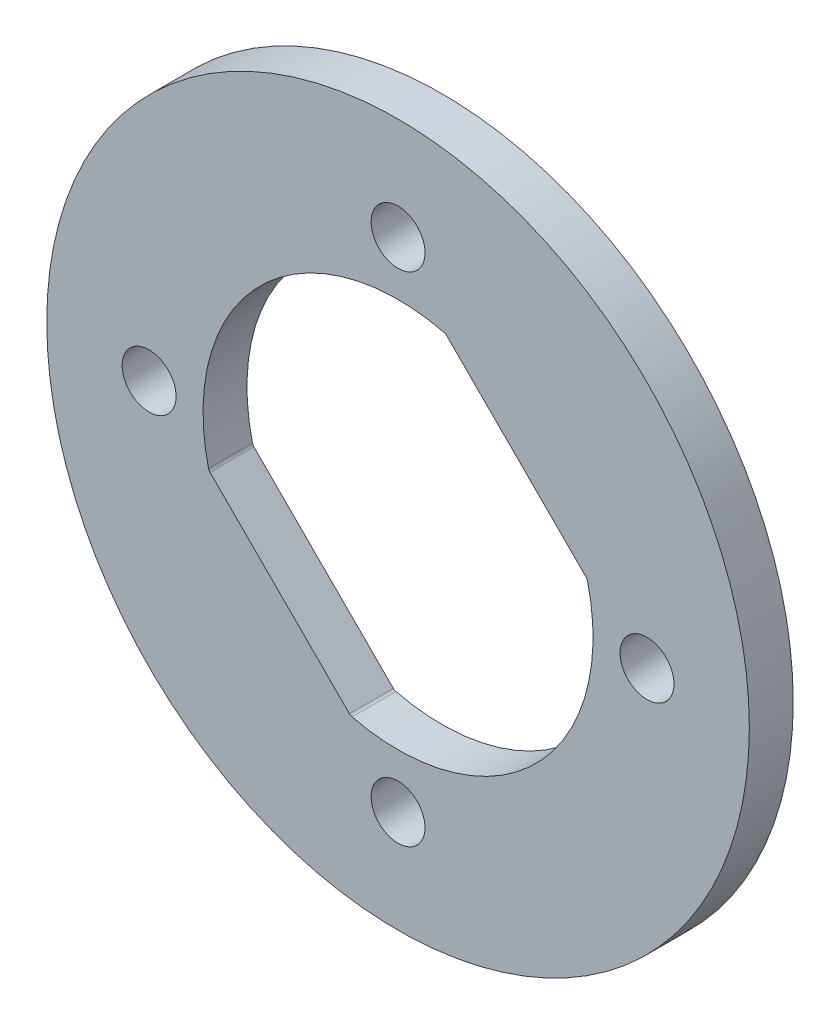
ISO-10303-21;
HEADER;
FILE_DESCRIPTION(('STEP AP214'),'2;1');
FILE_NAME('part.step','',(''),(''),'','','');
FILE_SCHEMA(('AUTOMOTIVE_DESIGN { 1 0 10303 214 1 1 1 1 }'));
ENDSEC;
DATA;
#1=APPLICATION_CONTEXT('core data for automotive mechanical design processes');
#2=APPLICATION_PROTOCOL_DEFINITION('international standard','automotive_design',2000,#1);
#3=PRODUCT_CONTEXT('',#1,'mechanical');
#4=PRODUCT('Part','Part','',(#3));
#5=PRODUCT_RELATED_PRODUCT_CATEGORY('part','',(#4));
#6=PRODUCT_DEFINITION_FORMATION('','',#4);
#7=PRODUCT_DEFINITION_CONTEXT('part definition',#1,'design');
#8=PRODUCT_DEFINITION('design','',#6,#7);
#9=PRODUCT_DEFINITION_SHAPE('','',#8);
#10=(LENGTH_UNIT() NAMED_UNIT(*) SI_UNIT(.MILLI.,.METRE.));
#11=(NAMED_UNIT(*) PLANE_ANGLE_UNIT() SI_UNIT($,.RADIAN.));
#12=(NAMED_UNIT(*) SI_UNIT($,.STERADIAN.) SOLID_ANGLE_UNIT());
#13=UNCERTAINTY_MEASURE_WITH_UNIT(LENGTH_MEASURE(1.E-05),#10,'distance_accuracy_value','');
#14=(GEOMETRIC_REPRESENTATION_CONTEXT(3) GLOBAL_UNCERTAINTY_ASSIGNED_CONTEXT((#13)) GLOBAL_UNIT_ASSIGNED_CONTEXT((#10,
#11,#12)) REPRESENTATION_CONTEXT('',''));
#15=CARTESIAN_POINT('',(0.,0.,0.));
#16=DIRECTION('',(0.,0.,1.));
#17=DIRECTION('',(1.,0.,0.));
#18=AXIS2_PLACEMENT_3D('',#15,#16,#17);
#19=CARTESIAN_POINT('',(6.65649530361137,1.61665403626971,1.5875));
#20=DIRECTION('',(0.,0.,-1.));
#21=DIRECTION('',(-1.,0.,0.));
#22=AXIS2_PLACEMENT_3D('',#19,#20,#21);
#23=CYLINDRICAL_SURFACE('',#22,0.200000000000003);
#24=CARTESIAN_POINT('',(6.65649530361137,1.61665403626971,0.));
#25=DIRECTION('',(0.,0.,1.));
#26=DIRECTION('',(1.,0.,0.));
#27=AXIS2_PLACEMENT_3D('',#24,#25,#26);
#28=CIRCLE('',#27,0.200000000000003);
#29=CARTESIAN_POINT('',(6.85084553145407,1.66385561397105,0.));
#30=VERTEX_POINT('',#29);
#31=CARTESIAN_POINT('',(6.79791665984868,1.75807539250702,0.));
#32=VERTEX_POINT('',#31);
#33=EDGE_CURVE('E149',#30,#32,#28,.T.);
#34=ORIENTED_EDGE('',*,*,#33,.F.);
#35=DIRECTION('',(0.,0.,-1.));
#36=VECTOR('',#35,1.);
#37=CARTESIAN_POINT('',(6.85084553145407,1.66385561397105,1.5875));
#38=LINE('',#37,#36);
#39=CARTESIAN_POINT('',(6.85084553145407,1.66385561397105,1.5875));
#40=VERTEX_POINT('',#39);
#41=EDGE_CURVE('E11',#40,#30,#38,.T.);
#42=ORIENTED_EDGE('',*,*,#41,.F.);
#43=CARTESIAN_POINT('',(6.65649530361137,1.61665403626971,1.5875));
#44=DIRECTION('',(0.,0.,1.));
#45=DIRECTION('',(1.,0.,0.));
#46=AXIS2_PLACEMENT_3D('',#43,#44,#45);
#47=CIRCLE('',#46,0.200000000000003);
#48=CARTESIAN_POINT('',(6.79791665984868,1.75807539250702,1.5875));
#49=VERTEX_POINT('',#48);
#50=EDGE_CURVE('E205',#40,#49,#47,.T.);
#51=ORIENTED_EDGE('',*,*,#50,.T.);
#52=DIRECTION('',(0.,0.,-1.));
#53=VECTOR('',#52,1.);
#54=CARTESIAN_POINT('',(6.79791665984868,1.75807539250702,1.5875));
#55=LINE('',#54,#53);
#56=EDGE_CURVE('E56',#49,#32,#55,.T.);
#57=ORIENTED_EDGE('',*,*,#56,.T.);
#58=EDGE_LOOP('',(#34,#42,#51,#57));
#59=FACE_BOUND('',#58,.T.);
#60=ADVANCED_FACE('F39',(#59),#23,.F.);
#61=CARTESIAN_POINT('',(-7.58941520739853E-13,-7.58941520739853E-13,1.5875));
#62=DIRECTION('',(0.,0.,-1.));
#63=DIRECTION('',(-1.,0.,0.));
#64=AXIS2_PLACEMENT_3D('',#61,#62,#63);
#65=CYLINDRICAL_SURFACE('',#64,7.05);
#66=CARTESIAN_POINT('',(-7.58941520739853E-13,-7.58941520739853E-13,0.));
#67=DIRECTION('',(0.,0.,1.));
#68=DIRECTION('',(1.,0.,0.));
#69=AXIS2_PLACEMENT_3D('',#66,#67,#68);
#70=CIRCLE('',#69,7.05);
#71=CARTESIAN_POINT('',(-1.66385561397256,-6.85084553145559,0.));
#72=VERTEX_POINT('',#71);
#73=EDGE_CURVE('E151',#72,#30,#70,.T.);
#74=ORIENTED_EDGE('',*,*,#73,.F.);
#75=DIRECTION('',(0.,0.,-1.));
#76=VECTOR('',#75,1.);
#77=CARTESIAN_POINT('',(-1.66385561397256,-6.85084553145559,1.5875));
#78=LINE('',#77,#76);
#79=CARTESIAN_POINT('',(-1.66385561397256,-6.85084553145559,1.5875));
#80=VERTEX_POINT('',#79);
#81=EDGE_CURVE('E48',#80,#72,#78,.T.);
#82=ORIENTED_EDGE('',*,*,#81,.F.);
#83=CARTESIAN_POINT('',(-7.58941520739853E-13,-7.58941520739853E-13,1.5875));
#84=DIRECTION('',(0.,0.,1.));
#85=DIRECTION('',(1.,0.,0.));
#86=AXIS2_PLACEMENT_3D('',#83,#84,#85);
#87=CIRCLE('',#86,7.05);
#88=EDGE_CURVE('E202',#80,#40,#87,.T.);
#89=ORIENTED_EDGE('',*,*,#88,.T.);
#90=ORIENTED_EDGE('',*,*,#41,.T.);
#91=EDGE_LOOP('',(#74,#82,#89,#90));
#92=FACE_BOUND('',#91,.T.);
#93=ADVANCED_FACE('F192',(#92),#65,.F.);
#94=CARTESIAN_POINT('',(-1.61665403627123,-6.65649530361288,1.5875));
#95=DIRECTION('',(0.,0.,-1.));
#96=DIRECTION('',(-1.,0.,0.));
#97=AXIS2_PLACEMENT_3D('',#94,#95,#96);
#98=CYLINDRICAL_SURFACE('',#97,0.200000000000011);
#99=CARTESIAN_POINT('',(-1.61665403627123,-6.65649530361288,0.));
#100=DIRECTION('',(0.,0.,1.));
#101=DIRECTION('',(1.,0.,0.));
#102=AXIS2_PLACEMENT_3D('',#99,#100,#101);
#103=CIRCLE('',#102,0.200000000000011);
#104=CARTESIAN_POINT('',(-1.75807539250854,-6.79791665985021,0.));
#105=VERTEX_POINT('',#104);
#106=EDGE_CURVE('E154',#105,#72,#103,.T.);
#107=ORIENTED_EDGE('',*,*,#106,.F.);
#108=DIRECTION('',(0.,0.,-1.));
#109=VECTOR('',#108,1.);
#110=CARTESIAN_POINT('',(-1.75807539250854,-6.79791665985021,1.5875));
#111=LINE('',#110,#109);
#112=CARTESIAN_POINT('',(-1.75807539250854,-6.79791665985021,1.5875));
#113=VERTEX_POINT('',#112);
#114=EDGE_CURVE('E181',#113,#105,#111,.T.);
#115=ORIENTED_EDGE('',*,*,#114,.F.);
#116=CARTESIAN_POINT('',(-1.61665403627123,-6.65649530361288,1.5875));
#117=DIRECTION('',(0.,0.,1.));
#118=DIRECTION('',(1.,0.,0.));
#119=AXIS2_PLACEMENT_3D('',#116,#117,#118);
#120=CIRCLE('',#119,0.200000000000011);
#121=EDGE_CURVE('E188',#113,#80,#120,.T.);
#122=ORIENTED_EDGE('',*,*,#121,.T.);
#123=ORIENTED_EDGE('',*,*,#81,.T.);
#124=EDGE_LOOP('',(#107,#115,#122,#123));
#125=FACE_BOUND('',#124,.T.);
#126=ADVANCED_FACE('F186',(#125),#98,.F.);
#127=CARTESIAN_POINT('',(-4.27799602617937,-4.27799602617937,1.5875));
#128=DIRECTION('',(0.707106781186548,0.707106781186548,0.));
#129=DIRECTION('',(-0.707106781186548,0.707106781186548,0.));
#130=AXIS2_PLACEMENT_3D('',#127,#128,#129);
#131=PLANE('',#130);
#132=DIRECTION('',(0.707106781186548,-0.707106781186548,0.));
#133=VECTOR('',#132,1.);
#134=CARTESIAN_POINT('',(-4.27799602617937,-4.27799602617937,0.));
#135=LINE('',#134,#133);
#136=CARTESIAN_POINT('',(-6.7979166598502,-1.75807539250855,0.));
#137=VERTEX_POINT('',#136);
#138=EDGE_CURVE('E157',#137,#105,#135,.T.);
#139=ORIENTED_EDGE('',*,*,#138,.F.);
#140=DIRECTION('',(0.,0.,-1.));
#141=VECTOR('',#140,1.);
#142=CARTESIAN_POINT('',(-6.7979166598502,-1.75807539250855,1.5875));
#143=LINE('',#142,#141);
#144=CARTESIAN_POINT('',(-6.7979166598502,-1.75807539250855,1.5875));
#145=VERTEX_POINT('',#144);
#146=EDGE_CURVE('E179',#145,#137,#143,.T.);
#147=ORIENTED_EDGE('',*,*,#146,.F.);
#148=DIRECTION('',(0.707106781186548,-0.707106781186548,0.));
#149=VECTOR('',#148,1.);
#150=CARTESIAN_POINT('',(-4.27799602617937,-4.27799602617937,1.5875));
#151=LINE('',#150,#149);
#152=EDGE_CURVE('E201',#145,#113,#151,.T.);
#153=ORIENTED_EDGE('',*,*,#152,.T.);
#154=ORIENTED_EDGE('',*,*,#114,.T.);
#155=EDGE_LOOP('',(#139,#147,#153,#154));
#156=FACE_BOUND('',#155,.T.);
#157=ADVANCED_FACE('F199',(#156),#131,.T.);
#158=CARTESIAN_POINT('',(-6.65649530361289,-1.61665403627123,1.5875));
#159=DIRECTION('',(0.,0.,-1.));
#160=DIRECTION('',(-1.,0.,0.));
#161=AXIS2_PLACEMENT_3D('',#158,#159,#160);
#162=CYLINDRICAL_SURFACE('',#161,0.200000000000006);
#163=CARTESIAN_POINT('',(-6.65649530361289,-1.61665403627123,0.));
#164=DIRECTION('',(0.,0.,1.));
#165=DIRECTION('',(1.,0.,0.));
#166=AXIS2_PLACEMENT_3D('',#163,#164,#165);
#167=CIRCLE('',#166,0.200000000000006);
#168=CARTESIAN_POINT('',(-6.85084553145558,-1.66385561397256,0.));
#169=VERTEX_POINT('',#168);
#170=EDGE_CURVE('E160',#169,#137,#167,.T.);
#171=ORIENTED_EDGE('',*,*,#170,.F.);
#172=DIRECTION('',(0.,0.,-1.));
#173=VECTOR('',#172,1.);
#174=CARTESIAN_POINT('',(-6.85084553145558,-1.66385561397256,1.5875));
#175=LINE('',#174,#173);
#176=CARTESIAN_POINT('',(-6.85084553145558,-1.66385561397256,1.5875));
#177=VERTEX_POINT('',#176);
#178=EDGE_CURVE('E115',#177,#169,#175,.T.);
#179=ORIENTED_EDGE('',*,*,#178,.F.);
#180=CARTESIAN_POINT('',(-6.65649530361289,-1.61665403627123,1.5875));
#181=DIRECTION('',(0.,0.,1.));
#182=DIRECTION('',(1.,0.,0.));
#183=AXIS2_PLACEMENT_3D('',#180,#181,#182);
#184=CIRCLE('',#183,0.200000000000006);
#185=EDGE_CURVE('E126',#177,#145,#184,.T.);
#186=ORIENTED_EDGE('',*,*,#185,.T.);
#187=ORIENTED_EDGE('',*,*,#146,.T.);
#188=EDGE_LOOP('',(#171,#179,#186,#187));
#189=FACE_BOUND('',#188,.T.);
#190=ADVANCED_FACE('F209',(#189),#162,.F.);
#191=CARTESIAN_POINT('',(-7.58941520739853E-13,-7.58941520739853E-13,1.5875));
#192=DIRECTION('',(0.,0.,-1.));
#193=DIRECTION('',(-1.,0.,0.));
#194=AXIS2_PLACEMENT_3D('',#191,#192,#193);
#195=CYLINDRICAL_SURFACE('',#194,7.05);
#196=CARTESIAN_POINT('',(-7.58941520739853E-13,-7.58941520739853E-13,0.));
#197=DIRECTION('',(0.,0.,1.));
#198=DIRECTION('',(1.,0.,0.));
#199=AXIS2_PLACEMENT_3D('',#196,#197,#198);
#200=CIRCLE('',#199,7.05);
#201=CARTESIAN_POINT('',(1.66385561397104,6.85084553145406,0.));
#202=VERTEX_POINT('',#201);
#203=EDGE_CURVE('E111',#202,#169,#200,.T.);
#204=ORIENTED_EDGE('',*,*,#203,.F.);
#205=DIRECTION('',(0.,0.,-1.));
#206=VECTOR('',#205,1.);
#207=CARTESIAN_POINT('',(1.66385561397104,6.85084553145406,1.5875));
#208=LINE('',#207,#206);
#209=CARTESIAN_POINT('',(1.66385561397104,6.85084553145406,1.5875));
#210=VERTEX_POINT('',#209);
#211=EDGE_CURVE('E106',#210,#202,#208,.T.);
#212=ORIENTED_EDGE('',*,*,#211,.F.);
#213=CARTESIAN_POINT('',(-7.58941520739853E-13,-7.58941520739853E-13,1.5875));
#214=DIRECTION('',(0.,0.,1.));
#215=DIRECTION('',(1.,0.,0.));
#216=AXIS2_PLACEMENT_3D('',#213,#214,#215);
#217=CIRCLE('',#216,7.05);
#218=EDGE_CURVE('E109',#210,#177,#217,.T.);
#219=ORIENTED_EDGE('',*,*,#218,.T.);
#220=ORIENTED_EDGE('',*,*,#178,.T.);
#221=EDGE_LOOP('',(#204,#212,#219,#220));
#222=FACE_BOUND('',#221,.T.);
#223=ADVANCED_FACE('F108',(#222),#195,.F.);
#224=CARTESIAN_POINT('',(1.61665403626971,6.65649530361137,1.5875));
#225=DIRECTION('',(0.,0.,-1.));
#226=DIRECTION('',(-1.,0.,0.));
#227=AXIS2_PLACEMENT_3D('',#224,#225,#226);
#228=CYLINDRICAL_SURFACE('',#227,0.200000000000002);
#229=CARTESIAN_POINT('',(1.61665403626971,6.65649530361137,0.));
#230=DIRECTION('',(0.,0.,1.));
#231=DIRECTION('',(1.,0.,0.));
#232=AXIS2_PLACEMENT_3D('',#229,#230,#231);
#233=CIRCLE('',#232,0.200000000000002);
#234=CARTESIAN_POINT('',(1.75807539250702,6.79791665984869,0.));
#235=VERTEX_POINT('',#234);
#236=EDGE_CURVE('E164',#235,#202,#233,.T.);
#237=ORIENTED_EDGE('',*,*,#236,.F.);
#238=DIRECTION('',(0.,0.,-1.));
#239=VECTOR('',#238,1.);
#240=CARTESIAN_POINT('',(1.75807539250702,6.79791665984869,1.5875));
#241=LINE('',#240,#239);
#242=CARTESIAN_POINT('',(1.75807539250702,6.79791665984869,1.5875));
#243=VERTEX_POINT('',#242);
#244=EDGE_CURVE('E81',#243,#235,#241,.T.);
#245=ORIENTED_EDGE('',*,*,#244,.F.);
#246=CARTESIAN_POINT('',(1.61665403626971,6.65649530361137,1.5875));
#247=DIRECTION('',(0.,0.,1.));
#248=DIRECTION('',(1.,0.,0.));
#249=AXIS2_PLACEMENT_3D('',#246,#247,#248);
#250=CIRCLE('',#249,0.200000000000002);
#251=EDGE_CURVE('E123',#243,#210,#250,.T.);
#252=ORIENTED_EDGE('',*,*,#251,.T.);
#253=ORIENTED_EDGE('',*,*,#211,.T.);
#254=EDGE_LOOP('',(#237,#245,#252,#253));
#255=FACE_BOUND('',#254,.T.);
#256=ADVANCED_FACE('F128',(#255),#228,.F.);
#257=CARTESIAN_POINT('',(-7.58941520739853E-13,-9.00000013411121,1.5875));
#258=DIRECTION('',(0.,0.,-1.));
#259=DIRECTION('',(-1.,0.,0.));
#260=AXIS2_PLACEMENT_3D('',#257,#258,#259);
#261=CYLINDRICAL_SURFACE('',#260,0.975);
#262=CARTESIAN_POINT('',(-7.58941520739853E-13,-9.00000013411121,1.5875));
#263=DIRECTION('',(0.,0.,1.));
#264=DIRECTION('',(1.,0.,0.));
#265=AXIS2_PLACEMENT_3D('',#262,#263,#264);
#266=CIRCLE('',#265,0.975);
#267=CARTESIAN_POINT('',(0.974999999999241,-9.00000013411121,1.5875));
#268=VERTEX_POINT('',#267);
#269=EDGE_CURVE('E131',#268,#268,#266,.T.);
#270=ORIENTED_EDGE('',*,*,#269,.T.);
#271=EDGE_LOOP('',(#270));
#272=FACE_BOUND('',#271,.T.);
#273=CARTESIAN_POINT('',(-7.58941520739853E-13,-9.00000013411121,0.));
#274=DIRECTION('',(0.,0.,1.));
#275=DIRECTION('',(1.,0.,0.));
#276=AXIS2_PLACEMENT_3D('',#273,#274,#275);
#277=CIRCLE('',#276,0.975);
#278=CARTESIAN_POINT('',(0.974999999999241,-9.00000013411121,0.));
#279=VERTEX_POINT('',#278);
#280=EDGE_CURVE('E169',#279,#279,#277,.T.);
#281=ORIENTED_EDGE('',*,*,#280,.F.);
#282=EDGE_LOOP('',(#281));
#283=FACE_BOUND('',#282,.T.);
#284=ADVANCED_FACE('F213',(#272,#283),#261,.F.);
#285=CARTESIAN_POINT('',(4.27799602617785,4.27799602617785,1.5875));
#286=DIRECTION('',(-0.707106781186548,-0.707106781186547,0.));
#287=DIRECTION('',(0.707106781186547,-0.707106781186548,0.));
#288=AXIS2_PLACEMENT_3D('',#285,#286,#287);
#289=PLANE('',#288);
#290=DIRECTION('',(-0.707106781186547,0.707106781186548,0.));
#291=VECTOR('',#290,1.);
#292=CARTESIAN_POINT('',(4.27799602617785,4.27799602617785,0.));
#293=LINE('',#292,#291);
#294=EDGE_CURVE('E166',#32,#235,#293,.T.);
#295=ORIENTED_EDGE('',*,*,#294,.F.);
#296=ORIENTED_EDGE('',*,*,#56,.F.);
#297=DIRECTION('',(-0.707106781186547,0.707106781186548,0.));
#298=VECTOR('',#297,1.);
#299=CARTESIAN_POINT('',(4.27799602617785,4.27799602617785,1.5875));
#300=LINE('',#299,#298);
#301=EDGE_CURVE('E129',#49,#243,#300,.T.);
#302=ORIENTED_EDGE('',*,*,#301,.T.);
#303=ORIENTED_EDGE('',*,*,#244,.T.);
#304=EDGE_LOOP('',(#295,#296,#302,#303));
#305=FACE_BOUND('',#304,.T.);
#306=ADVANCED_FACE('F210',(#305),#289,.T.);
#307=CARTESIAN_POINT('',(9.00000013410969,-7.58941520739853E-13,1.5875));
#308=DIRECTION('',(0.,0.,-1.));
#309=DIRECTION('',(-1.,0.,0.));
#310=AXIS2_PLACEMENT_3D('',#307,#308,#309);
#311=CYLINDRICAL_SURFACE('',#310,0.975);
#312=CARTESIAN_POINT('',(9.00000013410969,-7.58941520739853E-13,1.5875));
#313=DIRECTION('',(0.,0.,1.));
#314=DIRECTION('',(1.,0.,0.));
#315=AXIS2_PLACEMENT_3D('',#312,#313,#314);
#316=CIRCLE('',#315,0.975);
#317=CARTESIAN_POINT('',(9.97500013410969,-7.58941520739853E-13,1.5875));
#318=VERTEX_POINT('',#317);
#319=EDGE_CURVE('E398',#318,#318,#316,.T.);
#320=ORIENTED_EDGE('',*,*,#319,.T.);
#321=EDGE_LOOP('',(#320));
#322=FACE_BOUND('',#321,.T.);
#323=CARTESIAN_POINT('',(9.00000013410969,-7.58941520739853E-13,0.));
#324=DIRECTION('',(0.,0.,1.));
#325=DIRECTION('',(1.,0.,0.));
#326=AXIS2_PLACEMENT_3D('',#323,#324,#325);
#327=CIRCLE('',#326,0.975);
#328=CARTESIAN_POINT('',(9.97500013410969,-7.58941520739853E-13,0.));
#329=VERTEX_POINT('',#328);
#330=EDGE_CURVE('E146',#329,#329,#327,.T.);
#331=ORIENTED_EDGE('',*,*,#330,.F.);
#332=EDGE_LOOP('',(#331));
#333=FACE_BOUND('',#332,.T.);
#334=ADVANCED_FACE('F212',(#322,#333),#311,.F.);
#335=CARTESIAN_POINT('',(-7.58941520739853E-13,9.00000013410969,1.5875));
#336=DIRECTION('',(0.,0.,-1.));
#337=DIRECTION('',(-1.,0.,0.));
#338=AXIS2_PLACEMENT_3D('',#335,#336,#337);
#339=CYLINDRICAL_SURFACE('',#338,0.975);
#340=CARTESIAN_POINT('',(-7.58941520739853E-13,9.00000013410969,1.5875));
#341=DIRECTION('',(0.,0.,1.));
#342=DIRECTION('',(1.,0.,0.));
#343=AXIS2_PLACEMENT_3D('',#340,#341,#342);
#344=CIRCLE('',#343,0.975);
#345=CARTESIAN_POINT('',(0.974999999999241,9.00000013410969,1.5875));
#346=VERTEX_POINT('',#345);
#347=EDGE_CURVE('E242',#346,#346,#344,.T.);
#348=ORIENTED_EDGE('',*,*,#347,.T.);
#349=EDGE_LOOP('',(#348));
#350=FACE_BOUND('',#349,.T.);
#351=CARTESIAN_POINT('',(-7.58941520739853E-13,9.00000013410969,0.));
#352=DIRECTION('',(0.,0.,1.));
#353=DIRECTION('',(1.,0.,0.));
#354=AXIS2_PLACEMENT_3D('',#351,#352,#353);
#355=CIRCLE('',#354,0.975);
#356=CARTESIAN_POINT('',(0.974999999999241,9.00000013410969,0.));
#357=VERTEX_POINT('',#356);
#358=EDGE_CURVE('E143',#357,#357,#355,.T.);
#359=ORIENTED_EDGE('',*,*,#358,.F.);
#360=EDGE_LOOP('',(#359));
#361=FACE_BOUND('',#360,.T.);
#362=ADVANCED_FACE('F219',(#350,#361),#339,.F.);
#363=CARTESIAN_POINT('',(-7.58941520739853E-13,-7.58941520739853E-13,1.5875));
#364=DIRECTION('',(0.,0.,-1.));
#365=DIRECTION('',(-1.,0.,0.));
#366=AXIS2_PLACEMENT_3D('',#363,#364,#365);
#367=CYLINDRICAL_SURFACE('',#366,12.7);
#368=CARTESIAN_POINT('',(-7.58941520739853E-13,-7.58941520739853E-13,1.5875));
#369=DIRECTION('',(0.,0.,1.));
#370=DIRECTION('',(1.,0.,0.));
#371=AXIS2_PLACEMENT_3D('',#368,#369,#370);
#372=CIRCLE('',#371,12.7);
#373=CARTESIAN_POINT('',(12.6999999999992,-7.58941520739853E-13,1.5875));
#374=VERTEX_POINT('',#373);
#375=EDGE_CURVE('E175',#374,#374,#372,.T.);
#376=ORIENTED_EDGE('',*,*,#375,.F.);
#377=EDGE_LOOP('',(#376));
#378=FACE_BOUND('',#377,.T.);
#379=CARTESIAN_POINT('',(-7.58941520739853E-13,-7.58941520739853E-13,0.));
#380=DIRECTION('',(0.,0.,1.));
#381=DIRECTION('',(1.,0.,0.));
#382=AXIS2_PLACEMENT_3D('',#379,#380,#381);
#383=CIRCLE('',#382,12.7);
#384=CARTESIAN_POINT('',(12.6999999999992,-7.58941520739853E-13,0.));
#385=VERTEX_POINT('',#384);
#386=EDGE_CURVE('E140',#385,#385,#383,.T.);
#387=ORIENTED_EDGE('',*,*,#386,.T.);
#388=EDGE_LOOP('',(#387));
#389=FACE_BOUND('',#388,.T.);
#390=ADVANCED_FACE('F41',(#378,#389),#367,.T.);
#391=CARTESIAN_POINT('',(-9.00000013411121,-7.58941520739853E-13,1.5875));
#392=DIRECTION('',(0.,0.,-1.));
#393=DIRECTION('',(-1.,0.,0.));
#394=AXIS2_PLACEMENT_3D('',#391,#392,#393);
#395=CYLINDRICAL_SURFACE('',#394,0.975);
#396=CARTESIAN_POINT('',(-9.00000013411121,-7.58941520739853E-13,1.5875));
#397=DIRECTION('',(0.,0.,1.));
#398=DIRECTION('',(1.,0.,0.));
#399=AXIS2_PLACEMENT_3D('',#396,#397,#398);
#400=CIRCLE('',#399,0.975);
#401=CARTESIAN_POINT('',(-8.02500013411121,-7.58941520739853E-13,1.5875));
#402=VERTEX_POINT('',#401);
#403=EDGE_CURVE('E137',#402,#402,#400,.T.);
#404=ORIENTED_EDGE('',*,*,#403,.T.);
#405=EDGE_LOOP('',(#404));
#406=FACE_BOUND('',#405,.T.);
#407=CARTESIAN_POINT('',(-9.00000013411121,-7.58941520739853E-13,0.));
#408=DIRECTION('',(0.,0.,1.));
#409=DIRECTION('',(1.,0.,0.));
#410=AXIS2_PLACEMENT_3D('',#407,#408,#409);
#411=CIRCLE('',#410,0.975);
#412=CARTESIAN_POINT('',(-8.02500013411121,-7.58941520739853E-13,0.));
#413=VERTEX_POINT('',#412);
#414=EDGE_CURVE('E172',#413,#413,#411,.T.);
#415=ORIENTED_EDGE('',*,*,#414,.F.);
#416=EDGE_LOOP('',(#415));
#417=FACE_BOUND('',#416,.T.);
#418=ADVANCED_FACE('F237',(#406,#417),#395,.F.);
#419=CARTESIAN_POINT('',(0.,0.,1.5875));
#420=DIRECTION('',(0.,0.,1.));
#421=DIRECTION('',(1.,0.,0.));
#422=AXIS2_PLACEMENT_3D('',#419,#420,#421);
#423=PLANE('',#422);
#424=ORIENTED_EDGE('',*,*,#375,.T.);
#425=EDGE_LOOP('',(#424));
#426=FACE_BOUND('',#425,.T.);
#427=ORIENTED_EDGE('',*,*,#347,.F.);
#428=EDGE_LOOP('',(#427));
#429=FACE_BOUND('',#428,.T.);
#430=ORIENTED_EDGE('',*,*,#319,.F.);
#431=EDGE_LOOP('',(#430));
#432=FACE_BOUND('',#431,.T.);
#433=ORIENTED_EDGE('',*,*,#50,.F.);
#434=ORIENTED_EDGE('',*,*,#88,.F.);
#435=ORIENTED_EDGE('',*,*,#121,.F.);
#436=ORIENTED_EDGE('',*,*,#152,.F.);
#437=ORIENTED_EDGE('',*,*,#185,.F.);
#438=ORIENTED_EDGE('',*,*,#218,.F.);
#439=ORIENTED_EDGE('',*,*,#251,.F.);
#440=ORIENTED_EDGE('',*,*,#301,.F.);
#441=EDGE_LOOP('',(#433,#434,#435,#436,#437,#438,#439,#440));
#442=FACE_BOUND('',#441,.T.);
#443=ORIENTED_EDGE('',*,*,#269,.F.);
#444=EDGE_LOOP('',(#443));
#445=FACE_BOUND('',#444,.T.);
#446=ORIENTED_EDGE('',*,*,#403,.F.);
#447=EDGE_LOOP('',(#446));
#448=FACE_BOUND('',#447,.T.);
#449=ADVANCED_FACE('F120',(#426,#429,#432,#442,#445,#448),#423,.T.);
#450=CARTESIAN_POINT('',(0.,0.,0.));
#451=DIRECTION('',(0.,0.,1.));
#452=DIRECTION('',(1.,0.,0.));
#453=AXIS2_PLACEMENT_3D('',#450,#451,#452);
#454=PLANE('',#453);
#455=ORIENTED_EDGE('',*,*,#386,.F.);
#456=EDGE_LOOP('',(#455));
#457=FACE_BOUND('',#456,.T.);
#458=ORIENTED_EDGE('',*,*,#358,.T.);
#459=EDGE_LOOP('',(#458));
#460=FACE_BOUND('',#459,.T.);
#461=ORIENTED_EDGE('',*,*,#330,.T.);
#462=EDGE_LOOP('',(#461));
#463=FACE_BOUND('',#462,.T.);
#464=ORIENTED_EDGE('',*,*,#33,.T.);
#465=ORIENTED_EDGE('',*,*,#294,.T.);
#466=ORIENTED_EDGE('',*,*,#236,.T.);
#467=ORIENTED_EDGE('',*,*,#203,.T.);
#468=ORIENTED_EDGE('',*,*,#170,.T.);
#469=ORIENTED_EDGE('',*,*,#138,.T.);
#470=ORIENTED_EDGE('',*,*,#106,.T.);
#471=ORIENTED_EDGE('',*,*,#73,.T.);
#472=EDGE_LOOP('',(#464,#465,#466,#467,#468,#469,#470,#471));
#473=FACE_BOUND('',#472,.T.);
#474=ORIENTED_EDGE('',*,*,#280,.T.);
#475=EDGE_LOOP('',(#474));
#476=FACE_BOUND('',#475,.T.);
#477=ORIENTED_EDGE('',*,*,#414,.T.);
#478=EDGE_LOOP('',(#477));
#479=FACE_BOUND('',#478,.T.);
#480=ADVANCED_FACE('F194',(#457,#460,#463,#473,#476,#479),#454,.F.);
#481=CLOSED_SHELL('',(#60,#93,#126,#157,#190,#223,#256,#284,#306,#334,#362,#390,#418,#449,#480));
#482=MANIFOLD_SOLID_BREP('B2',#481);
#483=ADVANCED_BREP_SHAPE_REPRESENTATION('',(#18,#482),#14);
#484=SHAPE_DEFINITION_REPRESENTATION(#9,#483);
ENDSEC;
END-ISO-10303-21;
